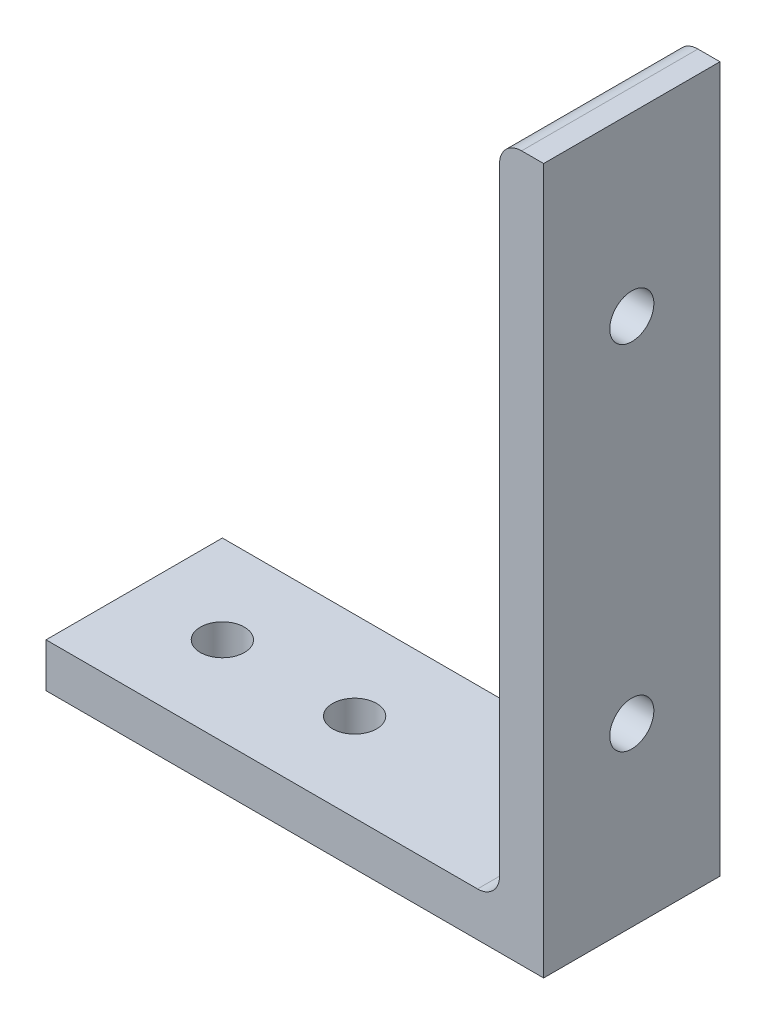
ISO-10303-21;
HEADER;
FILE_DESCRIPTION(('STEP AP214'),'2;1');
FILE_NAME('part.step','',(''),(''),'','','');
FILE_SCHEMA(('AUTOMOTIVE_DESIGN { 1 0 10303 214 1 1 1 1 }'));
ENDSEC;
DATA;
#1=APPLICATION_CONTEXT('core data for automotive mechanical design processes');
#2=APPLICATION_PROTOCOL_DEFINITION('international standard','automotive_design',2000,#1);
#3=PRODUCT_CONTEXT('',#1,'mechanical');
#4=PRODUCT('Part','Part','',(#3));
#5=PRODUCT_RELATED_PRODUCT_CATEGORY('part','',(#4));
#6=PRODUCT_DEFINITION_FORMATION('','',#4);
#7=PRODUCT_DEFINITION_CONTEXT('part definition',#1,'design');
#8=PRODUCT_DEFINITION('design','',#6,#7);
#9=PRODUCT_DEFINITION_SHAPE('','',#8);
#10=(LENGTH_UNIT() NAMED_UNIT(*) SI_UNIT(.MILLI.,.METRE.));
#11=(NAMED_UNIT(*) PLANE_ANGLE_UNIT() SI_UNIT($,.RADIAN.));
#12=(NAMED_UNIT(*) SI_UNIT($,.STERADIAN.) SOLID_ANGLE_UNIT());
#13=UNCERTAINTY_MEASURE_WITH_UNIT(LENGTH_MEASURE(1.E-05),#10,'distance_accuracy_value','');
#14=(GEOMETRIC_REPRESENTATION_CONTEXT(3) GLOBAL_UNCERTAINTY_ASSIGNED_CONTEXT((#13)) GLOBAL_UNIT_ASSIGNED_CONTEXT((#10,
#11,#12)) REPRESENTATION_CONTEXT('',''));
#15=CARTESIAN_POINT('',(0.,0.,0.));
#16=DIRECTION('',(0.,0.,1.));
#17=DIRECTION('',(1.,0.,0.));
#18=AXIS2_PLACEMENT_3D('',#15,#16,#17);
#19=CARTESIAN_POINT('',(-38.1,0.,12.7));
#20=DIRECTION('',(0.,1.,0.));
#21=DIRECTION('',(0.,0.,1.));
#22=AXIS2_PLACEMENT_3D('',#19,#20,#21);
#23=PLANE('',#22);
#24=CARTESIAN_POINT('',(-1.82626000000001,0.,0.));
#25=DIRECTION('',(0.,1.,0.));
#26=DIRECTION('',(-1.,0.,0.));
#27=AXIS2_PLACEMENT_3D('',#24,#25,#26);
#28=CIRCLE('',#27,3.175);
#29=CARTESIAN_POINT('',(-5.00126000000001,0.,0.));
#30=VERTEX_POINT('',#29);
#31=EDGE_CURVE('E201',#30,#30,#28,.T.);
#32=ORIENTED_EDGE('',*,*,#31,.T.);
#33=EDGE_LOOP('',(#32));
#34=FACE_BOUND('',#33,.T.);
#35=CARTESIAN_POINT('',(-20.87626,0.,0.));
#36=DIRECTION('',(0.,1.,0.));
#37=DIRECTION('',(-1.,0.,0.));
#38=AXIS2_PLACEMENT_3D('',#35,#36,#37);
#39=CIRCLE('',#38,3.175);
#40=CARTESIAN_POINT('',(-24.05126,0.,0.));
#41=VERTEX_POINT('',#40);
#42=EDGE_CURVE('E205',#41,#41,#39,.T.);
#43=ORIENTED_EDGE('',*,*,#42,.T.);
#44=EDGE_LOOP('',(#43));
#45=FACE_BOUND('',#44,.T.);
#46=DIRECTION('',(1.,0.,0.));
#47=VECTOR('',#46,1.);
#48=CARTESIAN_POINT('',(-38.1,0.,12.7));
#49=LINE('',#48,#47);
#50=CARTESIAN_POINT('',(-33.57626,0.,12.7));
#51=VERTEX_POINT('',#50);
#52=CARTESIAN_POINT('',(38.1,0.,12.7));
#53=VERTEX_POINT('',#52);
#54=EDGE_CURVE('E107',#51,#53,#49,.T.);
#55=ORIENTED_EDGE('',*,*,#54,.F.);
#56=DIRECTION('',(0.,0.,1.));
#57=VECTOR('',#56,1.);
#58=CARTESIAN_POINT('',(-33.57626,0.,-12.7));
#59=LINE('',#58,#57);
#60=CARTESIAN_POINT('',(-33.57626,0.,-12.7));
#61=VERTEX_POINT('',#60);
#62=EDGE_CURVE('E198',#61,#51,#59,.T.);
#63=ORIENTED_EDGE('',*,*,#62,.F.);
#64=DIRECTION('',(1.,0.,0.));
#65=VECTOR('',#64,1.);
#66=CARTESIAN_POINT('',(-38.1,0.,-12.7));
#67=LINE('',#66,#65);
#68=CARTESIAN_POINT('',(38.1,0.,-12.7));
#69=VERTEX_POINT('',#68);
#70=EDGE_CURVE('E147',#61,#69,#67,.T.);
#71=ORIENTED_EDGE('',*,*,#70,.T.);
#72=DIRECTION('',(0.,0.,-1.));
#73=VECTOR('',#72,1.);
#74=CARTESIAN_POINT('',(38.1,0.,12.7));
#75=LINE('',#74,#73);
#76=EDGE_CURVE('E57',#53,#69,#75,.T.);
#77=ORIENTED_EDGE('',*,*,#76,.F.);
#78=EDGE_LOOP('',(#55,#63,#71,#77));
#79=FACE_BOUND('',#78,.T.);
#80=ADVANCED_FACE('F50',(#34,#45,#79),#23,.F.);
#81=CARTESIAN_POINT('',(38.1,0.,12.7));
#82=DIRECTION('',(-1.,0.,0.));
#83=DIRECTION('',(0.,-1.,0.));
#84=AXIS2_PLACEMENT_3D('',#81,#82,#83);
#85=PLANE('',#84);
#86=CARTESIAN_POINT('',(38.1,76.2,0.));
#87=DIRECTION('',(1.,0.,0.));
#88=DIRECTION('',(0.,1.,0.));
#89=AXIS2_PLACEMENT_3D('',#86,#87,#88);
#90=CIRCLE('',#89,3.175);
#91=CARTESIAN_POINT('',(38.1,79.375,0.));
#92=VERTEX_POINT('',#91);
#93=EDGE_CURVE('E187',#92,#92,#90,.T.);
#94=ORIENTED_EDGE('',*,*,#93,.F.);
#95=EDGE_LOOP('',(#94));
#96=FACE_BOUND('',#95,.T.);
#97=CARTESIAN_POINT('',(38.1,25.4,0.));
#98=DIRECTION('',(1.,0.,0.));
#99=DIRECTION('',(0.,1.,0.));
#100=AXIS2_PLACEMENT_3D('',#97,#98,#99);
#101=CIRCLE('',#100,3.175);
#102=CARTESIAN_POINT('',(38.1,28.575,0.));
#103=VERTEX_POINT('',#102);
#104=EDGE_CURVE('E188',#103,#103,#101,.T.);
#105=ORIENTED_EDGE('',*,*,#104,.F.);
#106=EDGE_LOOP('',(#105));
#107=FACE_BOUND('',#106,.T.);
#108=DIRECTION('',(0.,1.,0.));
#109=VECTOR('',#108,1.);
#110=CARTESIAN_POINT('',(38.1,0.,-12.7));
#111=LINE('',#110,#109);
#112=CARTESIAN_POINT('',(38.1,101.6,-12.7));
#113=VERTEX_POINT('',#112);
#114=EDGE_CURVE('E149',#69,#113,#111,.T.);
#115=ORIENTED_EDGE('',*,*,#114,.T.);
#116=DIRECTION('',(0.,0.,-1.));
#117=VECTOR('',#116,1.);
#118=CARTESIAN_POINT('',(38.1,101.6,12.7));
#119=LINE('',#118,#117);
#120=CARTESIAN_POINT('',(38.1,101.6,12.7));
#121=VERTEX_POINT('',#120);
#122=EDGE_CURVE('E164',#121,#113,#119,.T.);
#123=ORIENTED_EDGE('',*,*,#122,.F.);
#124=DIRECTION('',(0.,1.,0.));
#125=VECTOR('',#124,1.);
#126=CARTESIAN_POINT('',(38.1,0.,12.7));
#127=LINE('',#126,#125);
#128=EDGE_CURVE('E172',#53,#121,#127,.T.);
#129=ORIENTED_EDGE('',*,*,#128,.F.);
#130=ORIENTED_EDGE('',*,*,#76,.T.);
#131=EDGE_LOOP('',(#115,#123,#129,#130));
#132=FACE_BOUND('',#131,.T.);
#133=ADVANCED_FACE('F170',(#96,#107,#132),#85,.F.);
#134=CARTESIAN_POINT('',(34.925,101.6,12.7));
#135=DIRECTION('',(0.,-1.,0.));
#136=DIRECTION('',(1.,0.,0.));
#137=AXIS2_PLACEMENT_3D('',#134,#135,#136);
#138=PLANE('',#137);
#139=DIRECTION('',(-1.,0.,0.));
#140=VECTOR('',#139,1.);
#141=CARTESIAN_POINT('',(34.925,101.6,-12.7));
#142=LINE('',#141,#140);
#143=CARTESIAN_POINT('',(34.925,101.6,-12.7));
#144=VERTEX_POINT('',#143);
#145=EDGE_CURVE('E152',#113,#144,#142,.T.);
#146=ORIENTED_EDGE('',*,*,#145,.T.);
#147=DIRECTION('',(0.,0.,-1.));
#148=VECTOR('',#147,1.);
#149=CARTESIAN_POINT('',(34.925,101.6,12.7));
#150=LINE('',#149,#148);
#151=CARTESIAN_POINT('',(34.925,101.6,12.7));
#152=VERTEX_POINT('',#151);
#153=EDGE_CURVE('E136',#152,#144,#150,.T.);
#154=ORIENTED_EDGE('',*,*,#153,.F.);
#155=DIRECTION('',(-1.,0.,0.));
#156=VECTOR('',#155,1.);
#157=CARTESIAN_POINT('',(34.925,101.6,12.7));
#158=LINE('',#157,#156);
#159=EDGE_CURVE('E124',#121,#152,#158,.T.);
#160=ORIENTED_EDGE('',*,*,#159,.F.);
#161=ORIENTED_EDGE('',*,*,#122,.T.);
#162=EDGE_LOOP('',(#146,#154,#160,#161));
#163=FACE_BOUND('',#162,.T.);
#164=ADVANCED_FACE('F180',(#163),#138,.F.);
#165=CARTESIAN_POINT('',(34.925,98.425,12.7));
#166=DIRECTION('',(0.,0.,-1.));
#167=DIRECTION('',(-1.,0.,0.));
#168=AXIS2_PLACEMENT_3D('',#165,#166,#167);
#169=CYLINDRICAL_SURFACE('',#168,3.175);
#170=CARTESIAN_POINT('',(34.925,98.425,-12.7));
#171=DIRECTION('',(0.,0.,1.));
#172=DIRECTION('',(-1.,0.,0.));
#173=AXIS2_PLACEMENT_3D('',#170,#171,#172);
#174=CIRCLE('',#173,3.175);
#175=CARTESIAN_POINT('',(31.75,98.425,-12.7));
#176=VERTEX_POINT('',#175);
#177=EDGE_CURVE('E133',#144,#176,#174,.T.);
#178=ORIENTED_EDGE('',*,*,#177,.T.);
#179=DIRECTION('',(0.,0.,-1.));
#180=VECTOR('',#179,1.);
#181=CARTESIAN_POINT('',(31.75,98.425,12.7));
#182=LINE('',#181,#180);
#183=CARTESIAN_POINT('',(31.75,98.425,12.7));
#184=VERTEX_POINT('',#183);
#185=EDGE_CURVE('E130',#184,#176,#182,.T.);
#186=ORIENTED_EDGE('',*,*,#185,.F.);
#187=CARTESIAN_POINT('',(34.925,98.425,12.7));
#188=DIRECTION('',(0.,0.,1.));
#189=DIRECTION('',(-1.,0.,0.));
#190=AXIS2_PLACEMENT_3D('',#187,#188,#189);
#191=CIRCLE('',#190,3.175);
#192=EDGE_CURVE('E117',#152,#184,#191,.T.);
#193=ORIENTED_EDGE('',*,*,#192,.F.);
#194=ORIENTED_EDGE('',*,*,#153,.T.);
#195=EDGE_LOOP('',(#178,#186,#193,#194));
#196=FACE_BOUND('',#195,.T.);
#197=ADVANCED_FACE('F131',(#196),#169,.T.);
#198=CARTESIAN_POINT('',(31.75,98.425,12.7));
#199=DIRECTION('',(1.,0.,0.));
#200=DIRECTION('',(0.,1.,0.));
#201=AXIS2_PLACEMENT_3D('',#198,#199,#200);
#202=PLANE('',#201);
#203=CARTESIAN_POINT('',(31.75,76.2,0.));
#204=DIRECTION('',(1.,0.,0.));
#205=DIRECTION('',(0.,1.,0.));
#206=AXIS2_PLACEMENT_3D('',#203,#204,#205);
#207=CIRCLE('',#206,3.175);
#208=CARTESIAN_POINT('',(31.75,79.375,0.));
#209=VERTEX_POINT('',#208);
#210=EDGE_CURVE('E150',#209,#209,#207,.F.);
#211=ORIENTED_EDGE('',*,*,#210,.F.);
#212=EDGE_LOOP('',(#211));
#213=FACE_BOUND('',#212,.T.);
#214=CARTESIAN_POINT('',(31.75,25.4,0.));
#215=DIRECTION('',(1.,0.,0.));
#216=DIRECTION('',(0.,1.,0.));
#217=AXIS2_PLACEMENT_3D('',#214,#215,#216);
#218=CIRCLE('',#217,3.175);
#219=CARTESIAN_POINT('',(31.75,28.575,0.));
#220=VERTEX_POINT('',#219);
#221=EDGE_CURVE('E184',#220,#220,#218,.F.);
#222=ORIENTED_EDGE('',*,*,#221,.F.);
#223=EDGE_LOOP('',(#222));
#224=FACE_BOUND('',#223,.T.);
#225=DIRECTION('',(0.,-1.,0.));
#226=VECTOR('',#225,1.);
#227=CARTESIAN_POINT('',(31.75,98.425,-12.7));
#228=LINE('',#227,#226);
#229=CARTESIAN_POINT('',(31.75,9.52499999999999,-12.7));
#230=VERTEX_POINT('',#229);
#231=EDGE_CURVE('E155',#176,#230,#228,.T.);
#232=ORIENTED_EDGE('',*,*,#231,.T.);
#233=DIRECTION('',(0.,0.,-1.));
#234=VECTOR('',#233,1.);
#235=CARTESIAN_POINT('',(31.75,9.52499999999999,12.7));
#236=LINE('',#235,#234);
#237=CARTESIAN_POINT('',(31.75,9.52499999999999,12.7));
#238=VERTEX_POINT('',#237);
#239=EDGE_CURVE('E137',#238,#230,#236,.T.);
#240=ORIENTED_EDGE('',*,*,#239,.F.);
#241=DIRECTION('',(0.,-1.,0.));
#242=VECTOR('',#241,1.);
#243=CARTESIAN_POINT('',(31.75,98.425,12.7));
#244=LINE('',#243,#242);
#245=EDGE_CURVE('E121',#184,#238,#244,.T.);
#246=ORIENTED_EDGE('',*,*,#245,.F.);
#247=ORIENTED_EDGE('',*,*,#185,.T.);
#248=EDGE_LOOP('',(#232,#240,#246,#247));
#249=FACE_BOUND('',#248,.T.);
#250=ADVANCED_FACE('F139',(#213,#224,#249),#202,.F.);
#251=CARTESIAN_POINT('',(28.575,9.52499999999999,12.7));
#252=DIRECTION('',(0.,0.,-1.));
#253=DIRECTION('',(-1.,0.,0.));
#254=AXIS2_PLACEMENT_3D('',#251,#252,#253);
#255=CYLINDRICAL_SURFACE('',#254,3.175);
#256=CARTESIAN_POINT('',(28.575,9.52499999999999,-12.7));
#257=DIRECTION('',(0.,0.,-1.));
#258=DIRECTION('',(-1.,0.,0.));
#259=AXIS2_PLACEMENT_3D('',#256,#257,#258);
#260=CIRCLE('',#259,3.175);
#261=CARTESIAN_POINT('',(28.575,6.35,-12.7));
#262=VERTEX_POINT('',#261);
#263=EDGE_CURVE('E99',#230,#262,#260,.T.);
#264=ORIENTED_EDGE('',*,*,#263,.T.);
#265=DIRECTION('',(0.,0.,-1.));
#266=VECTOR('',#265,1.);
#267=CARTESIAN_POINT('',(28.575,6.35,12.7));
#268=LINE('',#267,#266);
#269=CARTESIAN_POINT('',(28.575,6.35,12.7));
#270=VERTEX_POINT('',#269);
#271=EDGE_CURVE('E146',#270,#262,#268,.T.);
#272=ORIENTED_EDGE('',*,*,#271,.F.);
#273=CARTESIAN_POINT('',(28.575,9.52499999999999,12.7));
#274=DIRECTION('',(0.,0.,-1.));
#275=DIRECTION('',(-1.,0.,0.));
#276=AXIS2_PLACEMENT_3D('',#273,#274,#275);
#277=CIRCLE('',#276,3.175);
#278=EDGE_CURVE('E72',#238,#270,#277,.T.);
#279=ORIENTED_EDGE('',*,*,#278,.F.);
#280=ORIENTED_EDGE('',*,*,#239,.T.);
#281=EDGE_LOOP('',(#264,#272,#279,#280));
#282=FACE_BOUND('',#281,.T.);
#283=ADVANCED_FACE('F226',(#282),#255,.F.);
#284=CARTESIAN_POINT('',(28.575,6.35,12.7));
#285=DIRECTION('',(0.,-1.,0.));
#286=DIRECTION('',(1.,0.,0.));
#287=AXIS2_PLACEMENT_3D('',#284,#285,#286);
#288=PLANE('',#287);
#289=CARTESIAN_POINT('',(-1.82626000000001,6.35,0.));
#290=DIRECTION('',(0.,1.,0.));
#291=DIRECTION('',(-1.,0.,0.));
#292=AXIS2_PLACEMENT_3D('',#289,#290,#291);
#293=CIRCLE('',#292,3.175);
#294=CARTESIAN_POINT('',(-5.00126000000001,6.35,0.));
#295=VERTEX_POINT('',#294);
#296=EDGE_CURVE('E208',#295,#295,#293,.T.);
#297=ORIENTED_EDGE('',*,*,#296,.F.);
#298=EDGE_LOOP('',(#297));
#299=FACE_BOUND('',#298,.T.);
#300=CARTESIAN_POINT('',(-20.87626,6.34999999999999,0.));
#301=DIRECTION('',(0.,1.,0.));
#302=DIRECTION('',(-1.,0.,0.));
#303=AXIS2_PLACEMENT_3D('',#300,#301,#302);
#304=CIRCLE('',#303,3.175);
#305=CARTESIAN_POINT('',(-24.05126,6.34999999999999,0.));
#306=VERTEX_POINT('',#305);
#307=EDGE_CURVE('E202',#306,#306,#304,.T.);
#308=ORIENTED_EDGE('',*,*,#307,.F.);
#309=EDGE_LOOP('',(#308));
#310=FACE_BOUND('',#309,.T.);
#311=DIRECTION('',(-1.,0.,0.));
#312=VECTOR('',#311,1.);
#313=CARTESIAN_POINT('',(28.575,6.35,-12.7));
#314=LINE('',#313,#312);
#315=CARTESIAN_POINT('',(-33.57626,6.34999999999999,-12.7));
#316=VERTEX_POINT('',#315);
#317=EDGE_CURVE('E158',#262,#316,#314,.T.);
#318=ORIENTED_EDGE('',*,*,#317,.T.);
#319=DIRECTION('',(0.,0.,1.));
#320=VECTOR('',#319,1.);
#321=CARTESIAN_POINT('',(-33.57626,6.34999999999999,12.7));
#322=LINE('',#321,#320);
#323=CARTESIAN_POINT('',(-33.57626,6.34999999999999,12.7));
#324=VERTEX_POINT('',#323);
#325=EDGE_CURVE('E63',#316,#324,#322,.T.);
#326=ORIENTED_EDGE('',*,*,#325,.T.);
#327=DIRECTION('',(-1.,0.,0.));
#328=VECTOR('',#327,1.);
#329=CARTESIAN_POINT('',(28.575,6.35,12.7));
#330=LINE('',#329,#328);
#331=EDGE_CURVE('E141',#270,#324,#330,.T.);
#332=ORIENTED_EDGE('',*,*,#331,.F.);
#333=ORIENTED_EDGE('',*,*,#271,.T.);
#334=EDGE_LOOP('',(#318,#326,#332,#333));
#335=FACE_BOUND('',#334,.T.);
#336=ADVANCED_FACE('F223',(#299,#310,#335),#288,.F.);
#337=CARTESIAN_POINT('',(34.925,98.425,12.7));
#338=DIRECTION('',(0.,0.,-1.));
#339=DIRECTION('',(-1.,0.,0.));
#340=AXIS2_PLACEMENT_3D('',#337,#338,#339);
#341=PLANE('',#340);
#342=ORIENTED_EDGE('',*,*,#331,.T.);
#343=DIRECTION('',(0.,-1.,0.));
#344=VECTOR('',#343,1.);
#345=CARTESIAN_POINT('',(-33.57626,98.425,12.7));
#346=LINE('',#345,#344);
#347=EDGE_CURVE('E196',#324,#51,#346,.T.);
#348=ORIENTED_EDGE('',*,*,#347,.T.);
#349=ORIENTED_EDGE('',*,*,#54,.T.);
#350=ORIENTED_EDGE('',*,*,#128,.T.);
#351=ORIENTED_EDGE('',*,*,#159,.T.);
#352=ORIENTED_EDGE('',*,*,#192,.T.);
#353=ORIENTED_EDGE('',*,*,#245,.T.);
#354=ORIENTED_EDGE('',*,*,#278,.T.);
#355=EDGE_LOOP('',(#342,#348,#349,#350,#351,#352,#353,#354));
#356=FACE_BOUND('',#355,.T.);
#357=ADVANCED_FACE('F119',(#356),#341,.F.);
#358=CARTESIAN_POINT('',(34.925,98.425,-12.7));
#359=DIRECTION('',(0.,0.,-1.));
#360=DIRECTION('',(-1.,0.,0.));
#361=AXIS2_PLACEMENT_3D('',#358,#359,#360);
#362=PLANE('',#361);
#363=DIRECTION('',(0.,-1.,0.));
#364=VECTOR('',#363,1.);
#365=CARTESIAN_POINT('',(-33.57626,98.425,-12.7));
#366=LINE('',#365,#364);
#367=EDGE_CURVE('E13',#316,#61,#366,.T.);
#368=ORIENTED_EDGE('',*,*,#367,.F.);
#369=ORIENTED_EDGE('',*,*,#317,.F.);
#370=ORIENTED_EDGE('',*,*,#263,.F.);
#371=ORIENTED_EDGE('',*,*,#231,.F.);
#372=ORIENTED_EDGE('',*,*,#177,.F.);
#373=ORIENTED_EDGE('',*,*,#145,.F.);
#374=ORIENTED_EDGE('',*,*,#114,.F.);
#375=ORIENTED_EDGE('',*,*,#70,.F.);
#376=EDGE_LOOP('',(#368,#369,#370,#371,#372,#373,#374,#375));
#377=FACE_BOUND('',#376,.T.);
#378=ADVANCED_FACE('F177',(#377),#362,.T.);
#379=CARTESIAN_POINT('',(-38.101,25.4,0.));
#380=DIRECTION('',(1.,0.,0.));
#381=DIRECTION('',(0.,1.,0.));
#382=AXIS2_PLACEMENT_3D('',#379,#380,#381);
#383=CYLINDRICAL_SURFACE('',#382,3.175);
#384=ORIENTED_EDGE('',*,*,#104,.T.);
#385=EDGE_LOOP('',(#384));
#386=FACE_BOUND('',#385,.T.);
#387=ORIENTED_EDGE('',*,*,#221,.T.);
#388=EDGE_LOOP('',(#387));
#389=FACE_BOUND('',#388,.T.);
#390=ADVANCED_FACE('F257',(#386,#389),#383,.F.);
#391=CARTESIAN_POINT('',(-38.101,76.2,0.));
#392=DIRECTION('',(1.,0.,0.));
#393=DIRECTION('',(0.,1.,0.));
#394=AXIS2_PLACEMENT_3D('',#391,#392,#393);
#395=CYLINDRICAL_SURFACE('',#394,3.175);
#396=ORIENTED_EDGE('',*,*,#93,.T.);
#397=EDGE_LOOP('',(#396));
#398=FACE_BOUND('',#397,.T.);
#399=ORIENTED_EDGE('',*,*,#210,.T.);
#400=EDGE_LOOP('',(#399));
#401=FACE_BOUND('',#400,.T.);
#402=ADVANCED_FACE('F262',(#398,#401),#395,.F.);
#403=CARTESIAN_POINT('',(-33.57626,0.,0.));
#404=DIRECTION('',(1.,0.,0.));
#405=DIRECTION('',(0.,0.,-1.));
#406=AXIS2_PLACEMENT_3D('',#403,#404,#405);
#407=PLANE('',#406);
#408=ORIENTED_EDGE('',*,*,#367,.T.);
#409=ORIENTED_EDGE('',*,*,#62,.T.);
#410=ORIENTED_EDGE('',*,*,#347,.F.);
#411=ORIENTED_EDGE('',*,*,#325,.F.);
#412=EDGE_LOOP('',(#408,#409,#410,#411));
#413=FACE_BOUND('',#412,.T.);
#414=ADVANCED_FACE('F233',(#413),#407,.F.);
#415=CARTESIAN_POINT('',(-20.87626,0.,0.));
#416=DIRECTION('',(0.,1.,0.));
#417=DIRECTION('',(-1.,0.,0.));
#418=AXIS2_PLACEMENT_3D('',#415,#416,#417);
#419=CYLINDRICAL_SURFACE('',#418,3.175);
#420=ORIENTED_EDGE('',*,*,#42,.F.);
#421=EDGE_LOOP('',(#420));
#422=FACE_BOUND('',#421,.T.);
#423=ORIENTED_EDGE('',*,*,#307,.T.);
#424=EDGE_LOOP('',(#423));
#425=FACE_BOUND('',#424,.T.);
#426=ADVANCED_FACE('F219',(#422,#425),#419,.F.);
#427=CARTESIAN_POINT('',(-1.82626000000001,0.,0.));
#428=DIRECTION('',(0.,1.,0.));
#429=DIRECTION('',(-1.,0.,0.));
#430=AXIS2_PLACEMENT_3D('',#427,#428,#429);
#431=CYLINDRICAL_SURFACE('',#430,3.175);
#432=ORIENTED_EDGE('',*,*,#31,.F.);
#433=EDGE_LOOP('',(#432));
#434=FACE_BOUND('',#433,.T.);
#435=ORIENTED_EDGE('',*,*,#296,.T.);
#436=EDGE_LOOP('',(#435));
#437=FACE_BOUND('',#436,.T.);
#438=ADVANCED_FACE('F216',(#434,#437),#431,.F.);
#439=CLOSED_SHELL('',(#80,#133,#164,#197,#250,#283,#336,#357,#378,#390,#402,#414,#426,#438));
#440=MANIFOLD_SOLID_BREP('B2',#439);
#441=ADVANCED_BREP_SHAPE_REPRESENTATION('',(#18,#440),#14);
#442=SHAPE_DEFINITION_REPRESENTATION(#9,#441);
ENDSEC;
END-ISO-10303-21;
